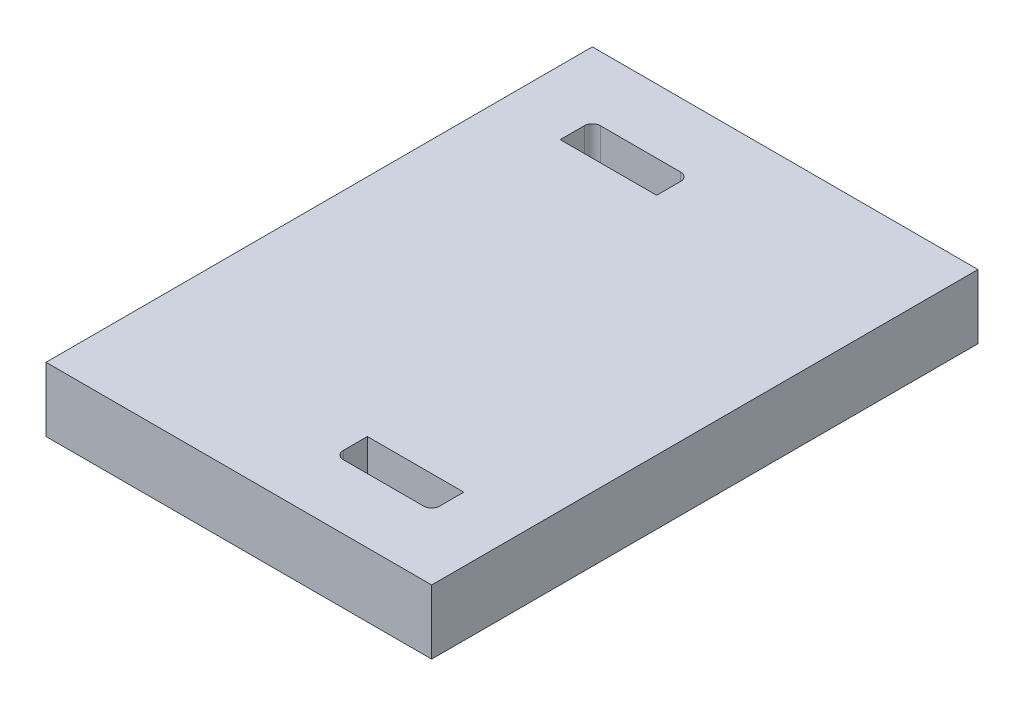
ISO-10303-21;
HEADER;
FILE_DESCRIPTION(('STEP AP214'),'2;1');
FILE_NAME('part.step','',(''),(''),'','','');
FILE_SCHEMA(('AUTOMOTIVE_DESIGN { 1 0 10303 214 1 1 1 1 }'));
ENDSEC;
DATA;
#1=APPLICATION_CONTEXT('core data for automotive mechanical design processes');
#2=APPLICATION_PROTOCOL_DEFINITION('international standard','automotive_design',2000,#1);
#3=PRODUCT_CONTEXT('',#1,'mechanical');
#4=PRODUCT('Part','Part','',(#3));
#5=PRODUCT_RELATED_PRODUCT_CATEGORY('part','',(#4));
#6=PRODUCT_DEFINITION_FORMATION('','',#4);
#7=PRODUCT_DEFINITION_CONTEXT('part definition',#1,'design');
#8=PRODUCT_DEFINITION('design','',#6,#7);
#9=PRODUCT_DEFINITION_SHAPE('','',#8);
#10=(LENGTH_UNIT() NAMED_UNIT(*) SI_UNIT(.MILLI.,.METRE.));
#11=(NAMED_UNIT(*) PLANE_ANGLE_UNIT() SI_UNIT($,.RADIAN.));
#12=(NAMED_UNIT(*) SI_UNIT($,.STERADIAN.) SOLID_ANGLE_UNIT());
#13=UNCERTAINTY_MEASURE_WITH_UNIT(LENGTH_MEASURE(1.E-05),#10,'distance_accuracy_value','');
#14=(GEOMETRIC_REPRESENTATION_CONTEXT(3) GLOBAL_UNCERTAINTY_ASSIGNED_CONTEXT((#13)) GLOBAL_UNIT_ASSIGNED_CONTEXT((#10,
#11,#12)) REPRESENTATION_CONTEXT('',''));
#15=CARTESIAN_POINT('',(0.,0.,0.));
#16=DIRECTION('',(0.,0.,1.));
#17=DIRECTION('',(1.,0.,0.));
#18=AXIS2_PLACEMENT_3D('',#15,#16,#17);
#19=CARTESIAN_POINT('',(0.,2.,0.));
#20=DIRECTION('',(0.,1.,0.));
#21=DIRECTION('',(0.,0.,1.));
#22=AXIS2_PLACEMENT_3D('',#19,#20,#21);
#23=PLANE('',#22);
#24=DIRECTION('',(1.,0.,0.));
#25=VECTOR('',#24,1.);
#26=CARTESIAN_POINT('',(0.,2.,0.));
#27=LINE('',#26,#25);
#28=CARTESIAN_POINT('',(0.,2.,0.));
#29=VERTEX_POINT('',#28);
#30=CARTESIAN_POINT('',(12.,2.,0.));
#31=VERTEX_POINT('',#30);
#32=EDGE_CURVE('E244',#29,#31,#27,.T.);
#33=ORIENTED_EDGE('',*,*,#32,.T.);
#34=DIRECTION('',(0.,0.,-1.));
#35=VECTOR('',#34,1.);
#36=CARTESIAN_POINT('',(12.,2.,0.));
#37=LINE('',#36,#35);
#38=CARTESIAN_POINT('',(12.,2.,-17.));
#39=VERTEX_POINT('',#38);
#40=EDGE_CURVE('E248',#31,#39,#37,.T.);
#41=ORIENTED_EDGE('',*,*,#40,.T.);
#42=DIRECTION('',(1.,0.,0.));
#43=VECTOR('',#42,1.);
#44=CARTESIAN_POINT('',(0.,2.,-17.));
#45=LINE('',#44,#43);
#46=CARTESIAN_POINT('',(0.,2.,-17.));
#47=VERTEX_POINT('',#46);
#48=EDGE_CURVE('E252',#47,#39,#45,.T.);
#49=ORIENTED_EDGE('',*,*,#48,.F.);
#50=DIRECTION('',(0.,0.,-1.));
#51=VECTOR('',#50,1.);
#52=CARTESIAN_POINT('',(0.,2.,0.));
#53=LINE('',#52,#51);
#54=EDGE_CURVE('E255',#29,#47,#53,.T.);
#55=ORIENTED_EDGE('',*,*,#54,.F.);
#56=EDGE_LOOP('',(#33,#41,#49,#55));
#57=FACE_BOUND('',#56,.T.);
#58=DIRECTION('',(0.,0.,1.));
#59=VECTOR('',#58,1.);
#60=CARTESIAN_POINT('',(2.,2.,-15.));
#61=LINE('',#60,#59);
#62=CARTESIAN_POINT('',(2.,2.,-14.75));
#63=VERTEX_POINT('',#62);
#64=CARTESIAN_POINT('',(2.,2.,-14.));
#65=VERTEX_POINT('',#64);
#66=EDGE_CURVE('E218',#63,#65,#61,.T.);
#67=ORIENTED_EDGE('',*,*,#66,.F.);
#68=CARTESIAN_POINT('',(2.25,2.,-14.75));
#69=DIRECTION('',(0.,1.,0.));
#70=DIRECTION('',(0.,0.,1.));
#71=AXIS2_PLACEMENT_3D('',#68,#69,#70);
#72=CIRCLE('',#71,0.25);
#73=CARTESIAN_POINT('',(2.25,2.,-15.));
#74=VERTEX_POINT('',#73);
#75=EDGE_CURVE('E53',#63,#74,#72,.F.);
#76=ORIENTED_EDGE('',*,*,#75,.T.);
#77=DIRECTION('',(1.,0.,0.));
#78=VECTOR('',#77,1.);
#79=CARTESIAN_POINT('',(2.,2.,-15.));
#80=LINE('',#79,#78);
#81=CARTESIAN_POINT('',(4.75,2.,-15.));
#82=VERTEX_POINT('',#81);
#83=EDGE_CURVE('E196',#74,#82,#80,.T.);
#84=ORIENTED_EDGE('',*,*,#83,.T.);
#85=CARTESIAN_POINT('',(4.75,2.,-14.75));
#86=DIRECTION('',(0.,1.,0.));
#87=DIRECTION('',(0.,0.,1.));
#88=AXIS2_PLACEMENT_3D('',#85,#86,#87);
#89=CIRCLE('',#88,0.25);
#90=CARTESIAN_POINT('',(5.,2.,-14.75));
#91=VERTEX_POINT('',#90);
#92=EDGE_CURVE('E323',#82,#91,#89,.F.);
#93=ORIENTED_EDGE('',*,*,#92,.T.);
#94=DIRECTION('',(0.,0.,1.));
#95=VECTOR('',#94,1.);
#96=CARTESIAN_POINT('',(5.,2.,-15.));
#97=LINE('',#96,#95);
#98=CARTESIAN_POINT('',(5.,2.,-14.));
#99=VERTEX_POINT('',#98);
#100=EDGE_CURVE('E226',#91,#99,#97,.T.);
#101=ORIENTED_EDGE('',*,*,#100,.T.);
#102=DIRECTION('',(1.,0.,0.));
#103=VECTOR('',#102,1.);
#104=CARTESIAN_POINT('',(2.,2.,-14.));
#105=LINE('',#104,#103);
#106=EDGE_CURVE('E221',#65,#99,#105,.T.);
#107=ORIENTED_EDGE('',*,*,#106,.F.);
#108=EDGE_LOOP('',(#67,#76,#84,#93,#101,#107));
#109=FACE_BOUND('',#108,.T.);
#110=DIRECTION('',(0.,0.,-1.));
#111=VECTOR('',#110,1.);
#112=CARTESIAN_POINT('',(10.,2.,0.));
#113=LINE('',#112,#111);
#114=CARTESIAN_POINT('',(10.,2.,-2.25));
#115=VERTEX_POINT('',#114);
#116=CARTESIAN_POINT('',(10.,2.,-3.));
#117=VERTEX_POINT('',#116);
#118=EDGE_CURVE('E176',#115,#117,#113,.T.);
#119=ORIENTED_EDGE('',*,*,#118,.F.);
#120=CARTESIAN_POINT('',(9.75,2.,-2.25));
#121=DIRECTION('',(0.,1.,0.));
#122=DIRECTION('',(0.,0.,1.));
#123=AXIS2_PLACEMENT_3D('',#120,#121,#122);
#124=CIRCLE('',#123,0.25);
#125=CARTESIAN_POINT('',(9.75,2.,-2.));
#126=VERTEX_POINT('',#125);
#127=EDGE_CURVE('E318',#115,#126,#124,.F.);
#128=ORIENTED_EDGE('',*,*,#127,.T.);
#129=DIRECTION('',(-1.,0.,0.));
#130=VECTOR('',#129,1.);
#131=CARTESIAN_POINT('',(0.,2.,-2.));
#132=LINE('',#131,#130);
#133=CARTESIAN_POINT('',(7.25,2.,-2.));
#134=VERTEX_POINT('',#133);
#135=EDGE_CURVE('E195',#126,#134,#132,.T.);
#136=ORIENTED_EDGE('',*,*,#135,.T.);
#137=CARTESIAN_POINT('',(7.25,2.,-2.25));
#138=DIRECTION('',(0.,1.,0.));
#139=DIRECTION('',(0.,0.,1.));
#140=AXIS2_PLACEMENT_3D('',#137,#138,#139);
#141=CIRCLE('',#140,0.25);
#142=CARTESIAN_POINT('',(7.,2.,-2.25));
#143=VERTEX_POINT('',#142);
#144=EDGE_CURVE('E312',#134,#143,#141,.F.);
#145=ORIENTED_EDGE('',*,*,#144,.T.);
#146=DIRECTION('',(0.,0.,-1.));
#147=VECTOR('',#146,1.);
#148=CARTESIAN_POINT('',(7.,2.,0.));
#149=LINE('',#148,#147);
#150=CARTESIAN_POINT('',(7.,2.,-3.));
#151=VERTEX_POINT('',#150);
#152=EDGE_CURVE('E192',#143,#151,#149,.T.);
#153=ORIENTED_EDGE('',*,*,#152,.T.);
#154=DIRECTION('',(-1.,0.,0.));
#155=VECTOR('',#154,1.);
#156=CARTESIAN_POINT('',(0.,2.,-3.));
#157=LINE('',#156,#155);
#158=EDGE_CURVE('E202',#117,#151,#157,.T.);
#159=ORIENTED_EDGE('',*,*,#158,.F.);
#160=EDGE_LOOP('',(#119,#128,#136,#145,#153,#159));
#161=FACE_BOUND('',#160,.T.);
#162=ADVANCED_FACE('F44',(#57,#109,#161),#23,.T.);
#163=CARTESIAN_POINT('',(0.,0.,0.));
#164=DIRECTION('',(0.,1.,0.));
#165=DIRECTION('',(0.,0.,1.));
#166=AXIS2_PLACEMENT_3D('',#163,#164,#165);
#167=PLANE('',#166);
#168=DIRECTION('',(1.,0.,0.));
#169=VECTOR('',#168,1.);
#170=CARTESIAN_POINT('',(2.,0.,-15.));
#171=LINE('',#170,#169);
#172=CARTESIAN_POINT('',(2.25,0.,-15.));
#173=VERTEX_POINT('',#172);
#174=CARTESIAN_POINT('',(4.75,0.,-15.));
#175=VERTEX_POINT('',#174);
#176=EDGE_CURVE('E222',#173,#175,#171,.T.);
#177=ORIENTED_EDGE('',*,*,#176,.F.);
#178=CARTESIAN_POINT('',(2.25,0.,-14.75));
#179=DIRECTION('',(0.,1.,0.));
#180=DIRECTION('',(0.,0.,1.));
#181=AXIS2_PLACEMENT_3D('',#178,#179,#180);
#182=CIRCLE('',#181,0.25);
#183=CARTESIAN_POINT('',(2.,0.,-14.75));
#184=VERTEX_POINT('',#183);
#185=EDGE_CURVE('E11',#173,#184,#182,.T.);
#186=ORIENTED_EDGE('',*,*,#185,.T.);
#187=DIRECTION('',(0.,0.,1.));
#188=VECTOR('',#187,1.);
#189=CARTESIAN_POINT('',(2.,0.,-15.));
#190=LINE('',#189,#188);
#191=CARTESIAN_POINT('',(2.,0.,-14.));
#192=VERTEX_POINT('',#191);
#193=EDGE_CURVE('E217',#184,#192,#190,.T.);
#194=ORIENTED_EDGE('',*,*,#193,.T.);
#195=DIRECTION('',(1.,0.,0.));
#196=VECTOR('',#195,1.);
#197=CARTESIAN_POINT('',(2.,0.,-14.));
#198=LINE('',#197,#196);
#199=CARTESIAN_POINT('',(5.,0.,-14.));
#200=VERTEX_POINT('',#199);
#201=EDGE_CURVE('E234',#192,#200,#198,.T.);
#202=ORIENTED_EDGE('',*,*,#201,.T.);
#203=DIRECTION('',(0.,0.,1.));
#204=VECTOR('',#203,1.);
#205=CARTESIAN_POINT('',(5.,0.,-15.));
#206=LINE('',#205,#204);
#207=CARTESIAN_POINT('',(5.,0.,-14.75));
#208=VERTEX_POINT('',#207);
#209=EDGE_CURVE('E238',#208,#200,#206,.T.);
#210=ORIENTED_EDGE('',*,*,#209,.F.);
#211=CARTESIAN_POINT('',(4.75,0.,-14.75));
#212=DIRECTION('',(0.,1.,0.));
#213=DIRECTION('',(0.,0.,1.));
#214=AXIS2_PLACEMENT_3D('',#211,#212,#213);
#215=CIRCLE('',#214,0.25);
#216=EDGE_CURVE('E326',#208,#175,#215,.T.);
#217=ORIENTED_EDGE('',*,*,#216,.T.);
#218=EDGE_LOOP('',(#177,#186,#194,#202,#210,#217));
#219=FACE_BOUND('',#218,.T.);
#220=DIRECTION('',(1.,0.,0.));
#221=VECTOR('',#220,1.);
#222=CARTESIAN_POINT('',(0.,0.,0.));
#223=LINE('',#222,#221);
#224=CARTESIAN_POINT('',(0.,0.,0.));
#225=VERTEX_POINT('',#224);
#226=CARTESIAN_POINT('',(12.,0.,0.));
#227=VERTEX_POINT('',#226);
#228=EDGE_CURVE('E207',#225,#227,#223,.T.);
#229=ORIENTED_EDGE('',*,*,#228,.F.);
#230=DIRECTION('',(0.,0.,-1.));
#231=VECTOR('',#230,1.);
#232=CARTESIAN_POINT('',(0.,0.,0.));
#233=LINE('',#232,#231);
#234=CARTESIAN_POINT('',(0.,0.,-17.));
#235=VERTEX_POINT('',#234);
#236=EDGE_CURVE('E249',#225,#235,#233,.T.);
#237=ORIENTED_EDGE('',*,*,#236,.T.);
#238=DIRECTION('',(1.,0.,0.));
#239=VECTOR('',#238,1.);
#240=CARTESIAN_POINT('',(0.,0.,-17.));
#241=LINE('',#240,#239);
#242=CARTESIAN_POINT('',(12.,0.,-17.));
#243=VERTEX_POINT('',#242);
#244=EDGE_CURVE('E267',#235,#243,#241,.T.);
#245=ORIENTED_EDGE('',*,*,#244,.T.);
#246=DIRECTION('',(0.,0.,-1.));
#247=VECTOR('',#246,1.);
#248=CARTESIAN_POINT('',(12.,0.,0.));
#249=LINE('',#248,#247);
#250=EDGE_CURVE('E263',#227,#243,#249,.T.);
#251=ORIENTED_EDGE('',*,*,#250,.F.);
#252=EDGE_LOOP('',(#229,#237,#245,#251));
#253=FACE_BOUND('',#252,.T.);
#254=DIRECTION('',(0.,0.,-1.));
#255=VECTOR('',#254,1.);
#256=CARTESIAN_POINT('',(7.,0.,0.));
#257=LINE('',#256,#255);
#258=CARTESIAN_POINT('',(7.,0.,-2.25));
#259=VERTEX_POINT('',#258);
#260=CARTESIAN_POINT('',(7.,0.,-3.));
#261=VERTEX_POINT('',#260);
#262=EDGE_CURVE('E205',#259,#261,#257,.T.);
#263=ORIENTED_EDGE('',*,*,#262,.F.);
#264=CARTESIAN_POINT('',(7.25,0.,-2.25));
#265=DIRECTION('',(0.,1.,0.));
#266=DIRECTION('',(0.,0.,1.));
#267=AXIS2_PLACEMENT_3D('',#264,#265,#266);
#268=CIRCLE('',#267,0.25);
#269=CARTESIAN_POINT('',(7.25,0.,-2.));
#270=VERTEX_POINT('',#269);
#271=EDGE_CURVE('E315',#259,#270,#268,.T.);
#272=ORIENTED_EDGE('',*,*,#271,.T.);
#273=DIRECTION('',(-1.,0.,0.));
#274=VECTOR('',#273,1.);
#275=CARTESIAN_POINT('',(0.,0.,-2.));
#276=LINE('',#275,#274);
#277=CARTESIAN_POINT('',(9.75,0.,-2.));
#278=VERTEX_POINT('',#277);
#279=EDGE_CURVE('E170',#278,#270,#276,.T.);
#280=ORIENTED_EDGE('',*,*,#279,.F.);
#281=CARTESIAN_POINT('',(9.75,0.,-2.25));
#282=DIRECTION('',(0.,1.,0.));
#283=DIRECTION('',(0.,0.,1.));
#284=AXIS2_PLACEMENT_3D('',#281,#282,#283);
#285=CIRCLE('',#284,0.25);
#286=CARTESIAN_POINT('',(10.,0.,-2.25));
#287=VERTEX_POINT('',#286);
#288=EDGE_CURVE('E165',#278,#287,#285,.T.);
#289=ORIENTED_EDGE('',*,*,#288,.T.);
#290=DIRECTION('',(0.,0.,-1.));
#291=VECTOR('',#290,1.);
#292=CARTESIAN_POINT('',(10.,0.,0.));
#293=LINE('',#292,#291);
#294=CARTESIAN_POINT('',(10.,0.,-3.));
#295=VERTEX_POINT('',#294);
#296=EDGE_CURVE('E157',#287,#295,#293,.T.);
#297=ORIENTED_EDGE('',*,*,#296,.T.);
#298=DIRECTION('',(-1.,0.,0.));
#299=VECTOR('',#298,1.);
#300=CARTESIAN_POINT('',(0.,0.,-3.));
#301=LINE('',#300,#299);
#302=EDGE_CURVE('E162',#295,#261,#301,.T.);
#303=ORIENTED_EDGE('',*,*,#302,.T.);
#304=EDGE_LOOP('',(#263,#272,#280,#289,#297,#303));
#305=FACE_BOUND('',#304,.T.);
#306=ADVANCED_FACE('F160',(#219,#253,#305),#167,.F.);
#307=CARTESIAN_POINT('',(0.,2.,0.));
#308=DIRECTION('',(0.,0.,-1.));
#309=DIRECTION('',(-1.,0.,0.));
#310=AXIS2_PLACEMENT_3D('',#307,#308,#309);
#311=PLANE('',#310);
#312=ORIENTED_EDGE('',*,*,#228,.T.);
#313=DIRECTION('',(0.,-1.,0.));
#314=VECTOR('',#313,1.);
#315=CARTESIAN_POINT('',(12.,2.,0.));
#316=LINE('',#315,#314);
#317=EDGE_CURVE('E282',#31,#227,#316,.T.);
#318=ORIENTED_EDGE('',*,*,#317,.F.);
#319=ORIENTED_EDGE('',*,*,#32,.F.);
#320=DIRECTION('',(0.,-1.,0.));
#321=VECTOR('',#320,1.);
#322=CARTESIAN_POINT('',(0.,2.,0.));
#323=LINE('',#322,#321);
#324=EDGE_CURVE('E259',#29,#225,#323,.T.);
#325=ORIENTED_EDGE('',*,*,#324,.T.);
#326=EDGE_LOOP('',(#312,#318,#319,#325));
#327=FACE_BOUND('',#326,.T.);
#328=ADVANCED_FACE('F367',(#327),#311,.F.);
#329=CARTESIAN_POINT('',(12.,2.,0.));
#330=DIRECTION('',(-1.,0.,0.));
#331=DIRECTION('',(0.,0.,1.));
#332=AXIS2_PLACEMENT_3D('',#329,#330,#331);
#333=PLANE('',#332);
#334=ORIENTED_EDGE('',*,*,#250,.T.);
#335=DIRECTION('',(0.,-1.,0.));
#336=VECTOR('',#335,1.);
#337=CARTESIAN_POINT('',(12.,2.,-17.));
#338=LINE('',#337,#336);
#339=EDGE_CURVE('E279',#39,#243,#338,.T.);
#340=ORIENTED_EDGE('',*,*,#339,.F.);
#341=ORIENTED_EDGE('',*,*,#40,.F.);
#342=ORIENTED_EDGE('',*,*,#317,.T.);
#343=EDGE_LOOP('',(#334,#340,#341,#342));
#344=FACE_BOUND('',#343,.T.);
#345=ADVANCED_FACE('F379',(#344),#333,.F.);
#346=CARTESIAN_POINT('',(0.,2.,-17.));
#347=DIRECTION('',(0.,0.,-1.));
#348=DIRECTION('',(-1.,0.,0.));
#349=AXIS2_PLACEMENT_3D('',#346,#347,#348);
#350=PLANE('',#349);
#351=ORIENTED_EDGE('',*,*,#244,.F.);
#352=DIRECTION('',(0.,-1.,0.));
#353=VECTOR('',#352,1.);
#354=CARTESIAN_POINT('',(0.,2.,-17.));
#355=LINE('',#354,#353);
#356=EDGE_CURVE('E276',#47,#235,#355,.T.);
#357=ORIENTED_EDGE('',*,*,#356,.F.);
#358=ORIENTED_EDGE('',*,*,#48,.T.);
#359=ORIENTED_EDGE('',*,*,#339,.T.);
#360=EDGE_LOOP('',(#351,#357,#358,#359));
#361=FACE_BOUND('',#360,.T.);
#362=ADVANCED_FACE('F375',(#361),#350,.T.);
#363=CARTESIAN_POINT('',(0.,2.,0.));
#364=DIRECTION('',(-1.,0.,0.));
#365=DIRECTION('',(0.,0.,1.));
#366=AXIS2_PLACEMENT_3D('',#363,#364,#365);
#367=PLANE('',#366);
#368=ORIENTED_EDGE('',*,*,#236,.F.);
#369=ORIENTED_EDGE('',*,*,#324,.F.);
#370=ORIENTED_EDGE('',*,*,#54,.T.);
#371=ORIENTED_EDGE('',*,*,#356,.T.);
#372=EDGE_LOOP('',(#368,#369,#370,#371));
#373=FACE_BOUND('',#372,.T.);
#374=ADVANCED_FACE('F372',(#373),#367,.T.);
#375=CARTESIAN_POINT('',(2.,0.,-15.));
#376=DIRECTION('',(0.,0.,1.));
#377=DIRECTION('',(1.,0.,0.));
#378=AXIS2_PLACEMENT_3D('',#375,#376,#377);
#379=PLANE('',#378);
#380=ORIENTED_EDGE('',*,*,#176,.T.);
#381=DIRECTION('',(0.,1.,0.));
#382=VECTOR('',#381,1.);
#383=CARTESIAN_POINT('',(4.75,2.,-15.));
#384=LINE('',#383,#382);
#385=EDGE_CURVE('E302',#175,#82,#384,.T.);
#386=ORIENTED_EDGE('',*,*,#385,.T.);
#387=ORIENTED_EDGE('',*,*,#83,.F.);
#388=DIRECTION('',(0.,1.,0.));
#389=VECTOR('',#388,1.);
#390=CARTESIAN_POINT('',(2.25,0.,-15.));
#391=LINE('',#390,#389);
#392=EDGE_CURVE('E299',#74,#173,#391,.F.);
#393=ORIENTED_EDGE('',*,*,#392,.T.);
#394=EDGE_LOOP('',(#380,#386,#387,#393));
#395=FACE_BOUND('',#394,.T.);
#396=ADVANCED_FACE('F334',(#395),#379,.T.);
#397=CARTESIAN_POINT('',(5.,0.,-15.));
#398=DIRECTION('',(-1.,0.,0.));
#399=DIRECTION('',(0.,0.,1.));
#400=AXIS2_PLACEMENT_3D('',#397,#398,#399);
#401=PLANE('',#400);
#402=ORIENTED_EDGE('',*,*,#100,.F.);
#403=DIRECTION('',(0.,1.,0.));
#404=VECTOR('',#403,1.);
#405=CARTESIAN_POINT('',(5.,0.,-14.75));
#406=LINE('',#405,#404);
#407=EDGE_CURVE('E306',#91,#208,#406,.F.);
#408=ORIENTED_EDGE('',*,*,#407,.T.);
#409=ORIENTED_EDGE('',*,*,#209,.T.);
#410=DIRECTION('',(0.,1.,0.));
#411=VECTOR('',#410,1.);
#412=CARTESIAN_POINT('',(5.,0.,-14.));
#413=LINE('',#412,#411);
#414=EDGE_CURVE('E209',#200,#99,#413,.T.);
#415=ORIENTED_EDGE('',*,*,#414,.T.);
#416=EDGE_LOOP('',(#402,#408,#409,#415));
#417=FACE_BOUND('',#416,.T.);
#418=ADVANCED_FACE('F347',(#417),#401,.T.);
#419=CARTESIAN_POINT('',(2.,0.,-14.));
#420=DIRECTION('',(0.,0.,1.));
#421=DIRECTION('',(1.,0.,0.));
#422=AXIS2_PLACEMENT_3D('',#419,#420,#421);
#423=PLANE('',#422);
#424=ORIENTED_EDGE('',*,*,#106,.T.);
#425=ORIENTED_EDGE('',*,*,#414,.F.);
#426=ORIENTED_EDGE('',*,*,#201,.F.);
#427=DIRECTION('',(0.,1.,0.));
#428=VECTOR('',#427,1.);
#429=CARTESIAN_POINT('',(2.,0.,-14.));
#430=LINE('',#429,#428);
#431=EDGE_CURVE('E213',#192,#65,#430,.T.);
#432=ORIENTED_EDGE('',*,*,#431,.T.);
#433=EDGE_LOOP('',(#424,#425,#426,#432));
#434=FACE_BOUND('',#433,.T.);
#435=ADVANCED_FACE('F344',(#434),#423,.F.);
#436=CARTESIAN_POINT('',(2.,0.,-15.));
#437=DIRECTION('',(-1.,0.,0.));
#438=DIRECTION('',(0.,0.,1.));
#439=AXIS2_PLACEMENT_3D('',#436,#437,#438);
#440=PLANE('',#439);
#441=ORIENTED_EDGE('',*,*,#193,.F.);
#442=DIRECTION('',(0.,1.,0.));
#443=VECTOR('',#442,1.);
#444=CARTESIAN_POINT('',(2.,0.,-14.75));
#445=LINE('',#444,#443);
#446=EDGE_CURVE('E309',#184,#63,#445,.T.);
#447=ORIENTED_EDGE('',*,*,#446,.T.);
#448=ORIENTED_EDGE('',*,*,#66,.T.);
#449=ORIENTED_EDGE('',*,*,#431,.F.);
#450=EDGE_LOOP('',(#441,#447,#448,#449));
#451=FACE_BOUND('',#450,.T.);
#452=ADVANCED_FACE('F337',(#451),#440,.F.);
#453=CARTESIAN_POINT('',(7.,0.,0.));
#454=DIRECTION('',(1.,0.,0.));
#455=DIRECTION('',(0.,0.,-1.));
#456=AXIS2_PLACEMENT_3D('',#453,#454,#455);
#457=PLANE('',#456);
#458=ORIENTED_EDGE('',*,*,#152,.F.);
#459=DIRECTION('',(0.,1.,0.));
#460=VECTOR('',#459,1.);
#461=CARTESIAN_POINT('',(7.,0.,-2.25));
#462=LINE('',#461,#460);
#463=EDGE_CURVE('E293',#143,#259,#462,.F.);
#464=ORIENTED_EDGE('',*,*,#463,.T.);
#465=ORIENTED_EDGE('',*,*,#262,.T.);
#466=DIRECTION('',(0.,1.,0.));
#467=VECTOR('',#466,1.);
#468=CARTESIAN_POINT('',(7.,0.,-3.));
#469=LINE('',#468,#467);
#470=EDGE_CURVE('E181',#261,#151,#469,.T.);
#471=ORIENTED_EDGE('',*,*,#470,.T.);
#472=EDGE_LOOP('',(#458,#464,#465,#471));
#473=FACE_BOUND('',#472,.T.);
#474=ADVANCED_FACE('F406',(#473),#457,.T.);
#475=CARTESIAN_POINT('',(0.,0.,-3.));
#476=DIRECTION('',(0.,0.,-1.));
#477=DIRECTION('',(-1.,0.,0.));
#478=AXIS2_PLACEMENT_3D('',#475,#476,#477);
#479=PLANE('',#478);
#480=ORIENTED_EDGE('',*,*,#158,.T.);
#481=ORIENTED_EDGE('',*,*,#470,.F.);
#482=ORIENTED_EDGE('',*,*,#302,.F.);
#483=DIRECTION('',(0.,1.,0.));
#484=VECTOR('',#483,1.);
#485=CARTESIAN_POINT('',(10.,0.,-3.));
#486=LINE('',#485,#484);
#487=EDGE_CURVE('E173',#295,#117,#486,.T.);
#488=ORIENTED_EDGE('',*,*,#487,.T.);
#489=EDGE_LOOP('',(#480,#481,#482,#488));
#490=FACE_BOUND('',#489,.T.);
#491=ADVANCED_FACE('F184',(#490),#479,.F.);
#492=CARTESIAN_POINT('',(10.,0.,0.));
#493=DIRECTION('',(1.,0.,0.));
#494=DIRECTION('',(0.,0.,-1.));
#495=AXIS2_PLACEMENT_3D('',#492,#493,#494);
#496=PLANE('',#495);
#497=ORIENTED_EDGE('',*,*,#296,.F.);
#498=DIRECTION('',(0.,1.,0.));
#499=VECTOR('',#498,1.);
#500=CARTESIAN_POINT('',(10.,0.,-2.25));
#501=LINE('',#500,#499);
#502=EDGE_CURVE('E296',#287,#115,#501,.T.);
#503=ORIENTED_EDGE('',*,*,#502,.T.);
#504=ORIENTED_EDGE('',*,*,#118,.T.);
#505=ORIENTED_EDGE('',*,*,#487,.F.);
#506=EDGE_LOOP('',(#497,#503,#504,#505));
#507=FACE_BOUND('',#506,.T.);
#508=ADVANCED_FACE('F174',(#507),#496,.F.);
#509=CARTESIAN_POINT('',(0.,0.,-2.));
#510=DIRECTION('',(0.,0.,-1.));
#511=DIRECTION('',(-1.,0.,0.));
#512=AXIS2_PLACEMENT_3D('',#509,#510,#511);
#513=PLANE('',#512);
#514=ORIENTED_EDGE('',*,*,#279,.T.);
#515=DIRECTION('',(0.,1.,0.));
#516=VECTOR('',#515,1.);
#517=CARTESIAN_POINT('',(7.25,2.,-2.));
#518=LINE('',#517,#516);
#519=EDGE_CURVE('E289',#270,#134,#518,.T.);
#520=ORIENTED_EDGE('',*,*,#519,.T.);
#521=ORIENTED_EDGE('',*,*,#135,.F.);
#522=DIRECTION('',(0.,1.,0.));
#523=VECTOR('',#522,1.);
#524=CARTESIAN_POINT('',(9.75,0.,-2.));
#525=LINE('',#524,#523);
#526=EDGE_CURVE('E286',#126,#278,#525,.F.);
#527=ORIENTED_EDGE('',*,*,#526,.T.);
#528=EDGE_LOOP('',(#514,#520,#521,#527));
#529=FACE_BOUND('',#528,.T.);
#530=ADVANCED_FACE('F388',(#529),#513,.T.);
#531=CARTESIAN_POINT('',(7.25,0.,-2.25));
#532=DIRECTION('',(0.,-1.,0.));
#533=DIRECTION('',(0.,0.,-1.));
#534=AXIS2_PLACEMENT_3D('',#531,#532,#533);
#535=CYLINDRICAL_SURFACE('',#534,0.25);
#536=ORIENTED_EDGE('',*,*,#271,.F.);
#537=ORIENTED_EDGE('',*,*,#463,.F.);
#538=ORIENTED_EDGE('',*,*,#144,.F.);
#539=ORIENTED_EDGE('',*,*,#519,.F.);
#540=EDGE_LOOP('',(#536,#537,#538,#539));
#541=FACE_BOUND('',#540,.T.);
#542=ADVANCED_FACE('F358',(#541),#535,.F.);
#543=CARTESIAN_POINT('',(9.75,0.,-2.25));
#544=DIRECTION('',(0.,1.,0.));
#545=DIRECTION('',(0.,0.,1.));
#546=AXIS2_PLACEMENT_3D('',#543,#544,#545);
#547=CYLINDRICAL_SURFACE('',#546,0.25);
#548=ORIENTED_EDGE('',*,*,#288,.F.);
#549=ORIENTED_EDGE('',*,*,#526,.F.);
#550=ORIENTED_EDGE('',*,*,#127,.F.);
#551=ORIENTED_EDGE('',*,*,#502,.F.);
#552=EDGE_LOOP('',(#548,#549,#550,#551));
#553=FACE_BOUND('',#552,.T.);
#554=ADVANCED_FACE('F353',(#553),#547,.F.);
#555=CARTESIAN_POINT('',(4.75,0.,-14.75));
#556=DIRECTION('',(0.,-1.,0.));
#557=DIRECTION('',(0.,0.,-1.));
#558=AXIS2_PLACEMENT_3D('',#555,#556,#557);
#559=CYLINDRICAL_SURFACE('',#558,0.25);
#560=ORIENTED_EDGE('',*,*,#216,.F.);
#561=ORIENTED_EDGE('',*,*,#407,.F.);
#562=ORIENTED_EDGE('',*,*,#92,.F.);
#563=ORIENTED_EDGE('',*,*,#385,.F.);
#564=EDGE_LOOP('',(#560,#561,#562,#563));
#565=FACE_BOUND('',#564,.T.);
#566=ADVANCED_FACE('F351',(#565),#559,.F.);
#567=CARTESIAN_POINT('',(2.25,0.,-14.75));
#568=DIRECTION('',(0.,1.,0.));
#569=DIRECTION('',(0.,0.,1.));
#570=AXIS2_PLACEMENT_3D('',#567,#568,#569);
#571=CYLINDRICAL_SURFACE('',#570,0.25);
#572=ORIENTED_EDGE('',*,*,#185,.F.);
#573=ORIENTED_EDGE('',*,*,#392,.F.);
#574=ORIENTED_EDGE('',*,*,#75,.F.);
#575=ORIENTED_EDGE('',*,*,#446,.F.);
#576=EDGE_LOOP('',(#572,#573,#574,#575));
#577=FACE_BOUND('',#576,.T.);
#578=ADVANCED_FACE('F46',(#577),#571,.F.);
#579=CLOSED_SHELL('',(#162,#306,#328,#345,#362,#374,#396,#418,#435,#452,#474,#491,#508,#530,
#542,#554,#566,#578));
#580=MANIFOLD_SOLID_BREP('B2',#579);
#581=ADVANCED_BREP_SHAPE_REPRESENTATION('',(#18,#580),#14);
#582=SHAPE_DEFINITION_REPRESENTATION(#9,#581);
ENDSEC;
END-ISO-10303-21;
